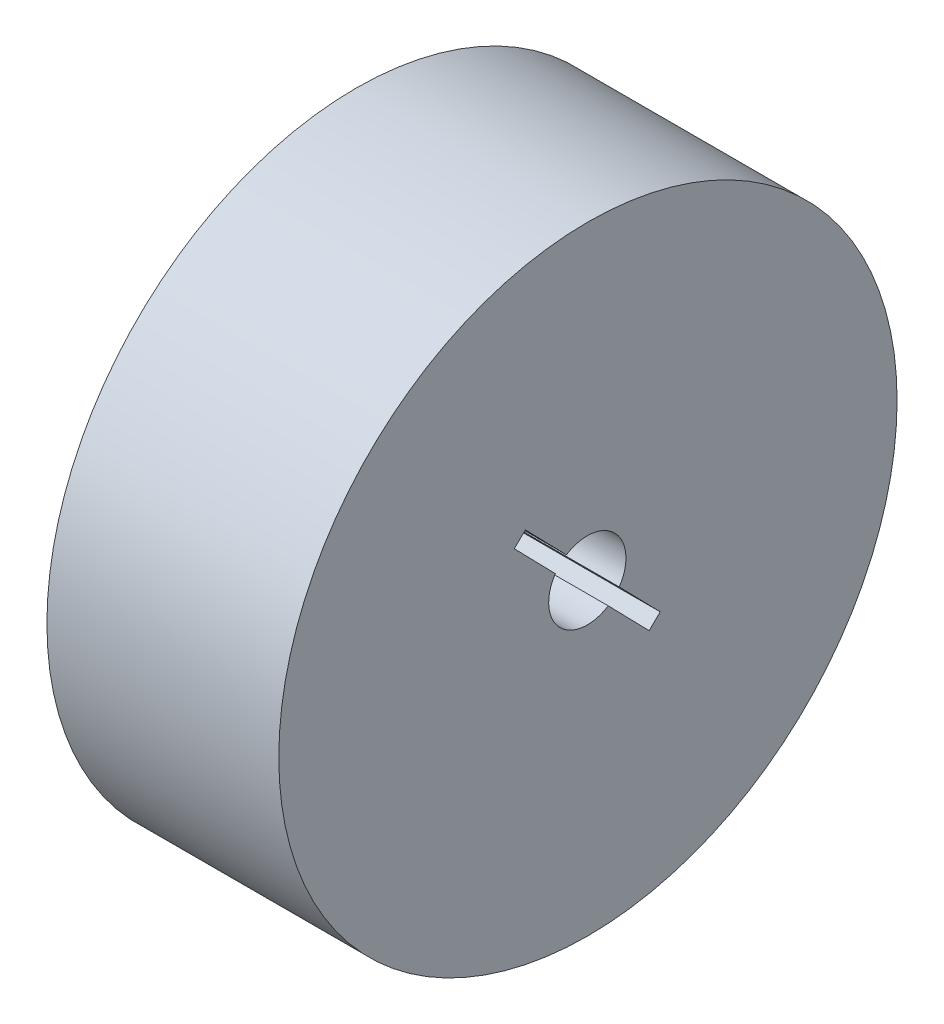
ISO-10303-21;
HEADER;
FILE_DESCRIPTION(('STEP AP214'),'2;1');
FILE_NAME('part.step','',(''),(''),'','','');
FILE_SCHEMA(('AUTOMOTIVE_DESIGN { 1 0 10303 214 1 1 1 1 }'));
ENDSEC;
DATA;
#1=APPLICATION_CONTEXT('core data for automotive mechanical design processes');
#2=APPLICATION_PROTOCOL_DEFINITION('international standard','automotive_design',2000,#1);
#3=PRODUCT_CONTEXT('',#1,'mechanical');
#4=PRODUCT('Part','Part','',(#3));
#5=PRODUCT_RELATED_PRODUCT_CATEGORY('part','',(#4));
#6=PRODUCT_DEFINITION_FORMATION('','',#4);
#7=PRODUCT_DEFINITION_CONTEXT('part definition',#1,'design');
#8=PRODUCT_DEFINITION('design','',#6,#7);
#9=PRODUCT_DEFINITION_SHAPE('','',#8);
#10=(LENGTH_UNIT() NAMED_UNIT(*) SI_UNIT(.MILLI.,.METRE.));
#11=(NAMED_UNIT(*) PLANE_ANGLE_UNIT() SI_UNIT($,.RADIAN.));
#12=(NAMED_UNIT(*) SI_UNIT($,.STERADIAN.) SOLID_ANGLE_UNIT());
#13=UNCERTAINTY_MEASURE_WITH_UNIT(LENGTH_MEASURE(1.E-05),#10,'distance_accuracy_value','');
#14=(GEOMETRIC_REPRESENTATION_CONTEXT(3) GLOBAL_UNCERTAINTY_ASSIGNED_CONTEXT((#13)) GLOBAL_UNIT_ASSIGNED_CONTEXT((#10,
#11,#12)) REPRESENTATION_CONTEXT('',''));
#15=CARTESIAN_POINT('',(0.,0.,0.));
#16=DIRECTION('',(0.,0.,1.));
#17=DIRECTION('',(1.,0.,0.));
#18=AXIS2_PLACEMENT_3D('',#15,#16,#17);
#19=CARTESIAN_POINT('',(30.,0.,0.));
#20=DIRECTION('',(1.,0.,0.));
#21=DIRECTION('',(0.,0.,-1.));
#22=AXIS2_PLACEMENT_3D('',#19,#20,#21);
#23=PLANE('',#22);
#24=CARTESIAN_POINT('',(30.,0.,0.));
#25=DIRECTION('',(1.,0.,0.));
#26=DIRECTION('',(0.,0.,-1.));
#27=AXIS2_PLACEMENT_3D('',#24,#25,#26);
#28=CIRCLE('',#27,40.);
#29=CARTESIAN_POINT('',(30.,0.,-40.));
#30=VERTEX_POINT('',#29);
#31=EDGE_CURVE('E11',#30,#30,#28,.T.);
#32=ORIENTED_EDGE('',*,*,#31,.T.);
#33=EDGE_LOOP('',(#32));
#34=FACE_BOUND('',#33,.T.);
#35=DIRECTION('',(0.,0.716251170960311,0.697842575440897));
#36=VECTOR('',#35,1.);
#37=CARTESIAN_POINT('',(30.,4.09215275080594,2.7813880720006));
#38=LINE('',#37,#36);
#39=CARTESIAN_POINT('',(30.,4.09215275080594,2.7813880720006));
#40=VERTEX_POINT('',#39);
#41=CARTESIAN_POINT('',(30.,9.5458926469176,8.09495969211348));
#42=VERTEX_POINT('',#41);
#43=EDGE_CURVE('E110',#40,#42,#38,.T.);
#44=ORIENTED_EDGE('',*,*,#43,.F.);
#45=CARTESIAN_POINT('',(30.,-0.11521318763546,0.0798936966514434));
#46=DIRECTION('',(1.,0.,0.));
#47=DIRECTION('',(0.,0.,-1.));
#48=AXIS2_PLACEMENT_3D('',#45,#46,#47);
#49=CIRCLE('',#48,5.);
#50=CARTESIAN_POINT('',(30.,-2.92531605178051,-4.05572256854094));
#51=VERTEX_POINT('',#50);
#52=EDGE_CURVE('E102',#51,#40,#49,.T.);
#53=ORIENTED_EDGE('',*,*,#52,.F.);
#54=DIRECTION('',(0.,0.716251170960311,0.697842575440897));
#55=VECTOR('',#54,1.);
#56=CARTESIAN_POINT('',(30.,-8.36038662709017,-9.35110469390894));
#57=LINE('',#56,#55);
#58=CARTESIAN_POINT('',(30.,-8.36038662709017,-9.35110469390894));
#59=VERTEX_POINT('',#58);
#60=EDGE_CURVE('E134',#59,#51,#57,.T.);
#61=ORIENTED_EDGE('',*,*,#60,.F.);
#62=DIRECTION('',(0.,0.697842575440896,-0.716251170960312));
#63=VECTOR('',#62,1.);
#64=CARTESIAN_POINT('',(30.,-9.75607177797196,-7.91860235198831));
#65=LINE('',#64,#63);
#66=CARTESIAN_POINT('',(30.,-9.75607177797196,-7.91860235198831));
#67=VERTEX_POINT('',#66);
#68=EDGE_CURVE('E132',#67,#59,#65,.T.);
#69=ORIENTED_EDGE('',*,*,#68,.F.);
#70=DIRECTION('',(0.,-0.716251170960311,-0.697842575440897));
#71=VECTOR('',#70,1.);
#72=CARTESIAN_POINT('',(30.,-4.32133179150684,-2.62354231889749));
#73=LINE('',#72,#71);
#74=CARTESIAN_POINT('',(30.,-4.32133179150684,-2.62354231889749));
#75=VERTEX_POINT('',#74);
#76=EDGE_CURVE('E130',#75,#67,#73,.T.);
#77=ORIENTED_EDGE('',*,*,#76,.F.);
#78=CARTESIAN_POINT('',(30.,-0.11521318763546,0.0798936966514434));
#79=DIRECTION('',(1.,0.,0.));
#80=DIRECTION('',(0.,0.,-1.));
#81=AXIS2_PLACEMENT_3D('',#78,#79,#80);
#82=CIRCLE('',#81,5.);
#83=CARTESIAN_POINT('',(30.,2.69679818876868,4.21421250619839));
#84=VERTEX_POINT('',#83);
#85=EDGE_CURVE('E128',#84,#75,#82,.T.);
#86=ORIENTED_EDGE('',*,*,#85,.F.);
#87=DIRECTION('',(0.,-0.716251170960311,-0.697842575440897));
#88=VECTOR('',#87,1.);
#89=CARTESIAN_POINT('',(30.,8.1502074960358,9.5274620340341));
#90=LINE('',#89,#88);
#91=CARTESIAN_POINT('',(30.,8.1502074960358,9.5274620340341));
#92=VERTEX_POINT('',#91);
#93=EDGE_CURVE('E124',#92,#84,#90,.T.);
#94=ORIENTED_EDGE('',*,*,#93,.F.);
#95=DIRECTION('',(0.,-0.697842575440897,0.716251170960311));
#96=VECTOR('',#95,1.);
#97=CARTESIAN_POINT('',(30.,9.5458926469176,8.09495969211348));
#98=LINE('',#97,#96);
#99=EDGE_CURVE('E122',#42,#92,#98,.T.);
#100=ORIENTED_EDGE('',*,*,#99,.F.);
#101=EDGE_LOOP('',(#44,#53,#61,#69,#77,#86,#94,#100));
#102=FACE_BOUND('',#101,.T.);
#103=ADVANCED_FACE('F37',(#34,#102),#23,.T.);
#104=CARTESIAN_POINT('',(0.,0.,0.));
#105=DIRECTION('',(1.,0.,0.));
#106=DIRECTION('',(0.,0.,-1.));
#107=AXIS2_PLACEMENT_3D('',#104,#105,#106);
#108=PLANE('',#107);
#109=CARTESIAN_POINT('',(0.,0.,0.));
#110=DIRECTION('',(1.,0.,0.));
#111=DIRECTION('',(0.,0.,-1.));
#112=AXIS2_PLACEMENT_3D('',#109,#110,#111);
#113=CIRCLE('',#112,40.);
#114=CARTESIAN_POINT('',(0.,0.,-40.));
#115=VERTEX_POINT('',#114);
#116=EDGE_CURVE('E41',#115,#115,#113,.T.);
#117=ORIENTED_EDGE('',*,*,#116,.F.);
#118=EDGE_LOOP('',(#117));
#119=FACE_BOUND('',#118,.T.);
#120=CARTESIAN_POINT('',(0.,-0.11521318763546,0.0798936966514434));
#121=DIRECTION('',(1.,0.,0.));
#122=DIRECTION('',(0.,0.,-1.));
#123=AXIS2_PLACEMENT_3D('',#120,#121,#122);
#124=CIRCLE('',#123,5.);
#125=CARTESIAN_POINT('',(0.,-2.92531605178051,-4.05572256854094));
#126=VERTEX_POINT('',#125);
#127=CARTESIAN_POINT('',(0.,4.09215275080594,2.7813880720006));
#128=VERTEX_POINT('',#127);
#129=EDGE_CURVE('E60',#126,#128,#124,.T.);
#130=ORIENTED_EDGE('',*,*,#129,.T.);
#131=DIRECTION('',(0.,0.716251170960311,0.697842575440897));
#132=VECTOR('',#131,1.);
#133=CARTESIAN_POINT('',(0.,4.09215275080594,2.7813880720006));
#134=LINE('',#133,#132);
#135=CARTESIAN_POINT('',(0.,9.5458926469176,8.09495969211348));
#136=VERTEX_POINT('',#135);
#137=EDGE_CURVE('E117',#128,#136,#134,.T.);
#138=ORIENTED_EDGE('',*,*,#137,.T.);
#139=DIRECTION('',(0.,-0.697842575440897,0.716251170960311));
#140=VECTOR('',#139,1.);
#141=CARTESIAN_POINT('',(0.,9.5458926469176,8.09495969211348));
#142=LINE('',#141,#140);
#143=CARTESIAN_POINT('',(0.,8.1502074960358,9.5274620340341));
#144=VERTEX_POINT('',#143);
#145=EDGE_CURVE('E138',#136,#144,#142,.T.);
#146=ORIENTED_EDGE('',*,*,#145,.T.);
#147=DIRECTION('',(0.,-0.716251170960311,-0.697842575440897));
#148=VECTOR('',#147,1.);
#149=CARTESIAN_POINT('',(0.,8.1502074960358,9.5274620340341));
#150=LINE('',#149,#148);
#151=CARTESIAN_POINT('',(0.,2.69679818876868,4.21421250619839));
#152=VERTEX_POINT('',#151);
#153=EDGE_CURVE('E141',#144,#152,#150,.T.);
#154=ORIENTED_EDGE('',*,*,#153,.T.);
#155=CARTESIAN_POINT('',(0.,-0.11521318763546,0.0798936966514434));
#156=DIRECTION('',(1.,0.,0.));
#157=DIRECTION('',(0.,0.,-1.));
#158=AXIS2_PLACEMENT_3D('',#155,#156,#157);
#159=CIRCLE('',#158,5.);
#160=CARTESIAN_POINT('',(0.,-4.32133179150684,-2.62354231889749));
#161=VERTEX_POINT('',#160);
#162=EDGE_CURVE('E144',#152,#161,#159,.T.);
#163=ORIENTED_EDGE('',*,*,#162,.T.);
#164=DIRECTION('',(0.,-0.716251170960311,-0.697842575440897));
#165=VECTOR('',#164,1.);
#166=CARTESIAN_POINT('',(0.,-4.32133179150684,-2.62354231889749));
#167=LINE('',#166,#165);
#168=CARTESIAN_POINT('',(0.,-9.75607177797196,-7.91860235198831));
#169=VERTEX_POINT('',#168);
#170=EDGE_CURVE('E147',#161,#169,#167,.T.);
#171=ORIENTED_EDGE('',*,*,#170,.T.);
#172=DIRECTION('',(0.,0.697842575440896,-0.716251170960312));
#173=VECTOR('',#172,1.);
#174=CARTESIAN_POINT('',(0.,-9.75607177797196,-7.91860235198831));
#175=LINE('',#174,#173);
#176=CARTESIAN_POINT('',(0.,-8.36038662709017,-9.35110469390894));
#177=VERTEX_POINT('',#176);
#178=EDGE_CURVE('E150',#169,#177,#175,.T.);
#179=ORIENTED_EDGE('',*,*,#178,.T.);
#180=DIRECTION('',(0.,0.716251170960311,0.697842575440897));
#181=VECTOR('',#180,1.);
#182=CARTESIAN_POINT('',(0.,-8.36038662709017,-9.35110469390894));
#183=LINE('',#182,#181);
#184=EDGE_CURVE('E111',#177,#126,#183,.T.);
#185=ORIENTED_EDGE('',*,*,#184,.T.);
#186=EDGE_LOOP('',(#130,#138,#146,#154,#163,#171,#179,#185));
#187=FACE_BOUND('',#186,.T.);
#188=ADVANCED_FACE('F171',(#119,#187),#108,.F.);
#189=CARTESIAN_POINT('',(30.,0.,0.));
#190=DIRECTION('',(-1.,0.,0.));
#191=DIRECTION('',(0.,0.,1.));
#192=AXIS2_PLACEMENT_3D('',#189,#190,#191);
#193=CYLINDRICAL_SURFACE('',#192,40.);
#194=ORIENTED_EDGE('',*,*,#31,.F.);
#195=EDGE_LOOP('',(#194));
#196=FACE_BOUND('',#195,.T.);
#197=ORIENTED_EDGE('',*,*,#116,.T.);
#198=EDGE_LOOP('',(#197));
#199=FACE_BOUND('',#198,.T.);
#200=ADVANCED_FACE('F39',(#196,#199),#193,.T.);
#201=CARTESIAN_POINT('',(30.,-0.11521318763546,0.0798936966514434));
#202=DIRECTION('',(-1.,0.,0.));
#203=DIRECTION('',(0.,0.,1.));
#204=AXIS2_PLACEMENT_3D('',#201,#202,#203);
#205=CYLINDRICAL_SURFACE('',#204,5.);
#206=ORIENTED_EDGE('',*,*,#129,.F.);
#207=DIRECTION('',(-1.,0.,0.));
#208=VECTOR('',#207,1.);
#209=CARTESIAN_POINT('',(30.,-2.92531605178051,-4.05572256854094));
#210=LINE('',#209,#208);
#211=EDGE_CURVE('E106',#51,#126,#210,.T.);
#212=ORIENTED_EDGE('',*,*,#211,.F.);
#213=ORIENTED_EDGE('',*,*,#52,.T.);
#214=DIRECTION('',(-1.,0.,0.));
#215=VECTOR('',#214,1.);
#216=CARTESIAN_POINT('',(30.,4.09215275080594,2.7813880720006));
#217=LINE('',#216,#215);
#218=EDGE_CURVE('E105',#40,#128,#217,.T.);
#219=ORIENTED_EDGE('',*,*,#218,.T.);
#220=EDGE_LOOP('',(#206,#212,#213,#219));
#221=FACE_BOUND('',#220,.T.);
#222=ADVANCED_FACE('F104',(#221),#205,.F.);
#223=CARTESIAN_POINT('',(30.,4.09215275080594,2.7813880720006));
#224=DIRECTION('',(0.,-0.697842575440897,0.716251170960311));
#225=DIRECTION('',(0.,-0.716251170960311,-0.697842575440897));
#226=AXIS2_PLACEMENT_3D('',#223,#224,#225);
#227=PLANE('',#226);
#228=ORIENTED_EDGE('',*,*,#137,.F.);
#229=ORIENTED_EDGE('',*,*,#218,.F.);
#230=ORIENTED_EDGE('',*,*,#43,.T.);
#231=DIRECTION('',(-1.,0.,0.));
#232=VECTOR('',#231,1.);
#233=CARTESIAN_POINT('',(30.,9.5458926469176,8.09495969211348));
#234=LINE('',#233,#232);
#235=EDGE_CURVE('E118',#42,#136,#234,.T.);
#236=ORIENTED_EDGE('',*,*,#235,.T.);
#237=EDGE_LOOP('',(#228,#229,#230,#236));
#238=FACE_BOUND('',#237,.T.);
#239=ADVANCED_FACE('F114',(#238),#227,.T.);
#240=CARTESIAN_POINT('',(30.,9.5458926469176,8.09495969211348));
#241=DIRECTION('',(0.,-0.716251170960311,-0.697842575440897));
#242=DIRECTION('',(0.,0.697842575440897,-0.716251170960311));
#243=AXIS2_PLACEMENT_3D('',#240,#241,#242);
#244=PLANE('',#243);
#245=ORIENTED_EDGE('',*,*,#145,.F.);
#246=ORIENTED_EDGE('',*,*,#235,.F.);
#247=ORIENTED_EDGE('',*,*,#99,.T.);
#248=DIRECTION('',(-1.,0.,0.));
#249=VECTOR('',#248,1.);
#250=CARTESIAN_POINT('',(30.,8.1502074960358,9.5274620340341));
#251=LINE('',#250,#249);
#252=EDGE_CURVE('E163',#92,#144,#251,.T.);
#253=ORIENTED_EDGE('',*,*,#252,.T.);
#254=EDGE_LOOP('',(#245,#246,#247,#253));
#255=FACE_BOUND('',#254,.T.);
#256=ADVANCED_FACE('F167',(#255),#244,.T.);
#257=CARTESIAN_POINT('',(30.,8.1502074960358,9.5274620340341));
#258=DIRECTION('',(0.,0.697842575440897,-0.716251170960311));
#259=DIRECTION('',(0.,0.716251170960311,0.697842575440897));
#260=AXIS2_PLACEMENT_3D('',#257,#258,#259);
#261=PLANE('',#260);
#262=ORIENTED_EDGE('',*,*,#153,.F.);
#263=ORIENTED_EDGE('',*,*,#252,.F.);
#264=ORIENTED_EDGE('',*,*,#93,.T.);
#265=DIRECTION('',(-1.,0.,0.));
#266=VECTOR('',#265,1.);
#267=CARTESIAN_POINT('',(30.,2.69679818876868,4.21421250619839));
#268=LINE('',#267,#266);
#269=EDGE_CURVE('E161',#84,#152,#268,.T.);
#270=ORIENTED_EDGE('',*,*,#269,.T.);
#271=EDGE_LOOP('',(#262,#263,#264,#270));
#272=FACE_BOUND('',#271,.T.);
#273=ADVANCED_FACE('F189',(#272),#261,.T.);
#274=CARTESIAN_POINT('',(30.,-0.11521318763546,0.0798936966514434));
#275=DIRECTION('',(-1.,0.,0.));
#276=DIRECTION('',(0.,0.,1.));
#277=AXIS2_PLACEMENT_3D('',#274,#275,#276);
#278=CYLINDRICAL_SURFACE('',#277,5.);
#279=ORIENTED_EDGE('',*,*,#162,.F.);
#280=ORIENTED_EDGE('',*,*,#269,.F.);
#281=ORIENTED_EDGE('',*,*,#85,.T.);
#282=DIRECTION('',(-1.,0.,0.));
#283=VECTOR('',#282,1.);
#284=CARTESIAN_POINT('',(30.,-4.32133179150684,-2.62354231889749));
#285=LINE('',#284,#283);
#286=EDGE_CURVE('E159',#75,#161,#285,.T.);
#287=ORIENTED_EDGE('',*,*,#286,.T.);
#288=EDGE_LOOP('',(#279,#280,#281,#287));
#289=FACE_BOUND('',#288,.T.);
#290=ADVANCED_FACE('F186',(#289),#278,.F.);
#291=CARTESIAN_POINT('',(30.,-4.32133179150684,-2.62354231889749));
#292=DIRECTION('',(0.,0.697842575440897,-0.716251170960311));
#293=DIRECTION('',(0.,0.716251170960311,0.697842575440897));
#294=AXIS2_PLACEMENT_3D('',#291,#292,#293);
#295=PLANE('',#294);
#296=ORIENTED_EDGE('',*,*,#170,.F.);
#297=ORIENTED_EDGE('',*,*,#286,.F.);
#298=ORIENTED_EDGE('',*,*,#76,.T.);
#299=DIRECTION('',(-1.,0.,0.));
#300=VECTOR('',#299,1.);
#301=CARTESIAN_POINT('',(30.,-9.75607177797196,-7.91860235198831));
#302=LINE('',#301,#300);
#303=EDGE_CURVE('E157',#67,#169,#302,.T.);
#304=ORIENTED_EDGE('',*,*,#303,.T.);
#305=EDGE_LOOP('',(#296,#297,#298,#304));
#306=FACE_BOUND('',#305,.T.);
#307=ADVANCED_FACE('F182',(#306),#295,.T.);
#308=CARTESIAN_POINT('',(30.,-9.75607177797196,-7.91860235198831));
#309=DIRECTION('',(0.,0.716251170960312,0.697842575440896));
#310=DIRECTION('',(0.,-0.697842575440896,0.716251170960312));
#311=AXIS2_PLACEMENT_3D('',#308,#309,#310);
#312=PLANE('',#311);
#313=ORIENTED_EDGE('',*,*,#178,.F.);
#314=ORIENTED_EDGE('',*,*,#303,.F.);
#315=ORIENTED_EDGE('',*,*,#68,.T.);
#316=DIRECTION('',(-1.,0.,0.));
#317=VECTOR('',#316,1.);
#318=CARTESIAN_POINT('',(30.,-8.36038662709017,-9.35110469390894));
#319=LINE('',#318,#317);
#320=EDGE_CURVE('E52',#59,#177,#319,.T.);
#321=ORIENTED_EDGE('',*,*,#320,.T.);
#322=EDGE_LOOP('',(#313,#314,#315,#321));
#323=FACE_BOUND('',#322,.T.);
#324=ADVANCED_FACE('F179',(#323),#312,.T.);
#325=CARTESIAN_POINT('',(30.,-8.36038662709017,-9.35110469390894));
#326=DIRECTION('',(0.,-0.697842575440897,0.716251170960311));
#327=DIRECTION('',(0.,-0.716251170960311,-0.697842575440897));
#328=AXIS2_PLACEMENT_3D('',#325,#326,#327);
#329=PLANE('',#328);
#330=ORIENTED_EDGE('',*,*,#184,.F.);
#331=ORIENTED_EDGE('',*,*,#320,.F.);
#332=ORIENTED_EDGE('',*,*,#60,.T.);
#333=ORIENTED_EDGE('',*,*,#211,.T.);
#334=EDGE_LOOP('',(#330,#331,#332,#333));
#335=FACE_BOUND('',#334,.T.);
#336=ADVANCED_FACE('F173',(#335),#329,.T.);
#337=CLOSED_SHELL('',(#103,#188,#200,#222,#239,#256,#273,#290,#307,#324,#336));
#338=MANIFOLD_SOLID_BREP('B2',#337);
#339=ADVANCED_BREP_SHAPE_REPRESENTATION('',(#18,#338),#14);
#340=SHAPE_DEFINITION_REPRESENTATION(#9,#339);
ENDSEC;
END-ISO-10303-21;
